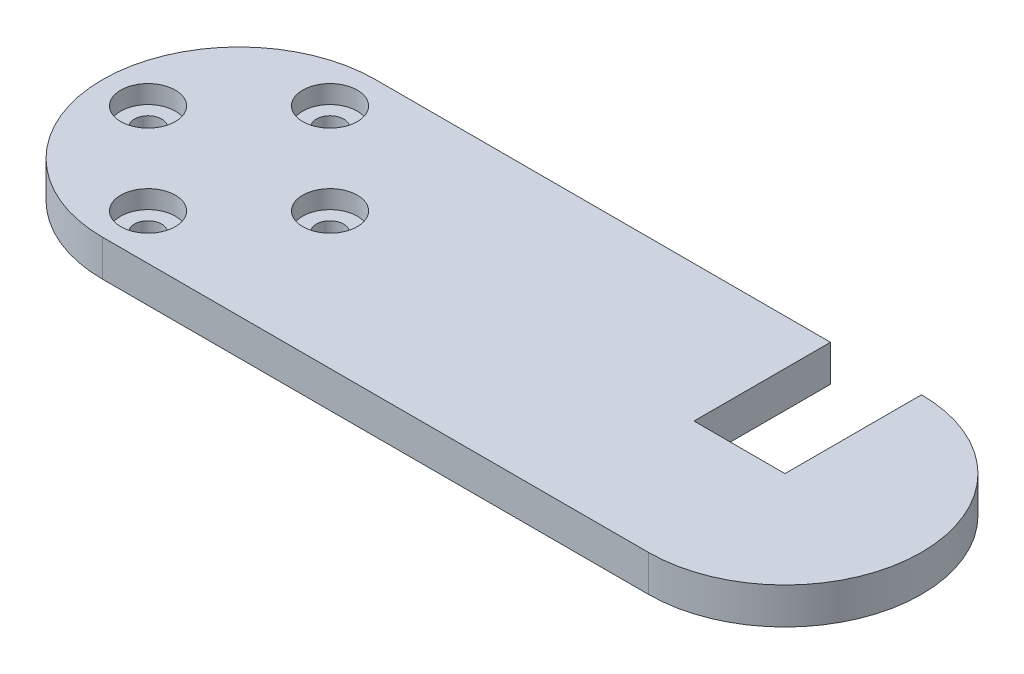
ISO-10303-21;
HEADER;
FILE_DESCRIPTION(('STEP AP214'),'2;1');
FILE_NAME('part.step','',(''),(''),'','','');
FILE_SCHEMA(('AUTOMOTIVE_DESIGN { 1 0 10303 214 1 1 1 1 }'));
ENDSEC;
DATA;
#1=APPLICATION_CONTEXT('core data for automotive mechanical design processes');
#2=APPLICATION_PROTOCOL_DEFINITION('international standard','automotive_design',2000,#1);
#3=PRODUCT_CONTEXT('',#1,'mechanical');
#4=PRODUCT('Part','Part','',(#3));
#5=PRODUCT_RELATED_PRODUCT_CATEGORY('part','',(#4));
#6=PRODUCT_DEFINITION_FORMATION('','',#4);
#7=PRODUCT_DEFINITION_CONTEXT('part definition',#1,'design');
#8=PRODUCT_DEFINITION('design','',#6,#7);
#9=PRODUCT_DEFINITION_SHAPE('','',#8);
#10=(LENGTH_UNIT() NAMED_UNIT(*) SI_UNIT(.MILLI.,.METRE.));
#11=(NAMED_UNIT(*) PLANE_ANGLE_UNIT() SI_UNIT($,.RADIAN.));
#12=(NAMED_UNIT(*) SI_UNIT($,.STERADIAN.) SOLID_ANGLE_UNIT());
#13=UNCERTAINTY_MEASURE_WITH_UNIT(LENGTH_MEASURE(1.E-05),#10,'distance_accuracy_value','');
#14=(GEOMETRIC_REPRESENTATION_CONTEXT(3) GLOBAL_UNCERTAINTY_ASSIGNED_CONTEXT((#13)) GLOBAL_UNIT_ASSIGNED_CONTEXT((#10,
#11,#12)) REPRESENTATION_CONTEXT('',''));
#15=CARTESIAN_POINT('',(0.,0.,0.));
#16=DIRECTION('',(0.,0.,1.));
#17=DIRECTION('',(1.,0.,0.));
#18=AXIS2_PLACEMENT_3D('',#15,#16,#17);
#19=CARTESIAN_POINT('',(0.,4.,-15.));
#20=DIRECTION('',(0.,0.,1.));
#21=DIRECTION('',(1.,0.,0.));
#22=AXIS2_PLACEMENT_3D('',#19,#20,#21);
#23=PLANE('',#22);
#24=DIRECTION('',(0.,1.,0.));
#25=VECTOR('',#24,1.);
#26=CARTESIAN_POINT('',(50.,0.,-15.));
#27=LINE('',#26,#25);
#28=CARTESIAN_POINT('',(50.,0.,-15.));
#29=VERTEX_POINT('',#28);
#30=CARTESIAN_POINT('',(50.,4.,-15.));
#31=VERTEX_POINT('',#30);
#32=EDGE_CURVE('E134',#29,#31,#27,.T.);
#33=ORIENTED_EDGE('',*,*,#32,.F.);
#34=DIRECTION('',(-1.,0.,0.));
#35=VECTOR('',#34,1.);
#36=CARTESIAN_POINT('',(0.,0.,-15.));
#37=LINE('',#36,#35);
#38=CARTESIAN_POINT('',(0.,0.,-15.));
#39=VERTEX_POINT('',#38);
#40=EDGE_CURVE('E78',#29,#39,#37,.T.);
#41=ORIENTED_EDGE('',*,*,#40,.T.);
#42=DIRECTION('',(0.,-1.,0.));
#43=VECTOR('',#42,1.);
#44=CARTESIAN_POINT('',(0.,4.,-15.));
#45=LINE('',#44,#43);
#46=CARTESIAN_POINT('',(0.,4.,-15.));
#47=VERTEX_POINT('',#46);
#48=EDGE_CURVE('E145',#47,#39,#45,.T.);
#49=ORIENTED_EDGE('',*,*,#48,.F.);
#50=DIRECTION('',(-1.,0.,0.));
#51=VECTOR('',#50,1.);
#52=CARTESIAN_POINT('',(0.,4.,-15.));
#53=LINE('',#52,#51);
#54=EDGE_CURVE('E60',#31,#47,#53,.T.);
#55=ORIENTED_EDGE('',*,*,#54,.F.);
#56=EDGE_LOOP('',(#33,#41,#49,#55));
#57=FACE_BOUND('',#56,.T.);
#58=ADVANCED_FACE('F36',(#57),#23,.F.);
#59=CARTESIAN_POINT('',(0.,4.,0.));
#60=DIRECTION('',(0.,1.,0.));
#61=DIRECTION('',(0.,0.,1.));
#62=AXIS2_PLACEMENT_3D('',#59,#60,#61);
#63=PLANE('',#62);
#64=CARTESIAN_POINT('',(-10.,4.,0.));
#65=DIRECTION('',(0.,1.,0.));
#66=DIRECTION('',(0.,0.,1.));
#67=AXIS2_PLACEMENT_3D('',#64,#65,#66);
#68=CIRCLE('',#67,3.);
#69=CARTESIAN_POINT('',(-10.,4.,3.));
#70=VERTEX_POINT('',#69);
#71=EDGE_CURVE('E272',#70,#70,#68,.T.);
#72=ORIENTED_EDGE('',*,*,#71,.F.);
#73=EDGE_LOOP('',(#72));
#74=FACE_BOUND('',#73,.T.);
#75=CARTESIAN_POINT('',(0.,4.,-10.));
#76=DIRECTION('',(0.,1.,0.));
#77=DIRECTION('',(0.,0.,1.));
#78=AXIS2_PLACEMENT_3D('',#75,#76,#77);
#79=CIRCLE('',#78,3.);
#80=CARTESIAN_POINT('',(0.,4.,-7.));
#81=VERTEX_POINT('',#80);
#82=EDGE_CURVE('E275',#81,#81,#79,.T.);
#83=ORIENTED_EDGE('',*,*,#82,.F.);
#84=EDGE_LOOP('',(#83));
#85=FACE_BOUND('',#84,.T.);
#86=CARTESIAN_POINT('',(10.,4.,0.));
#87=DIRECTION('',(0.,1.,0.));
#88=DIRECTION('',(0.,0.,1.));
#89=AXIS2_PLACEMENT_3D('',#86,#87,#88);
#90=CIRCLE('',#89,3.);
#91=CARTESIAN_POINT('',(10.,4.,3.00000000000007));
#92=VERTEX_POINT('',#91);
#93=EDGE_CURVE('E281',#92,#92,#90,.T.);
#94=ORIENTED_EDGE('',*,*,#93,.F.);
#95=EDGE_LOOP('',(#94));
#96=FACE_BOUND('',#95,.T.);
#97=CARTESIAN_POINT('',(-1.04744440165294E-13,4.,9.99999999999999));
#98=DIRECTION('',(0.,1.,0.));
#99=DIRECTION('',(0.,0.,1.));
#100=AXIS2_PLACEMENT_3D('',#97,#98,#99);
#101=CIRCLE('',#100,3.);
#102=CARTESIAN_POINT('',(-1.04744440165294E-13,4.,13.));
#103=VERTEX_POINT('',#102);
#104=EDGE_CURVE('E286',#103,#103,#101,.T.);
#105=ORIENTED_EDGE('',*,*,#104,.F.);
#106=EDGE_LOOP('',(#105));
#107=FACE_BOUND('',#106,.T.);
#108=DIRECTION('',(1.,0.,0.));
#109=VECTOR('',#108,1.);
#110=CARTESIAN_POINT('',(0.,4.,0.));
#111=LINE('',#110,#109);
#112=CARTESIAN_POINT('',(50.,4.,0.));
#113=VERTEX_POINT('',#112);
#114=CARTESIAN_POINT('',(60.,4.,0.));
#115=VERTEX_POINT('',#114);
#116=EDGE_CURVE('E124',#113,#115,#111,.T.);
#117=ORIENTED_EDGE('',*,*,#116,.F.);
#118=DIRECTION('',(0.,0.,-1.));
#119=VECTOR('',#118,1.);
#120=CARTESIAN_POINT('',(50.,4.,0.));
#121=LINE('',#120,#119);
#122=EDGE_CURVE('E109',#113,#31,#121,.T.);
#123=ORIENTED_EDGE('',*,*,#122,.T.);
#124=ORIENTED_EDGE('',*,*,#54,.T.);
#125=CARTESIAN_POINT('',(0.,4.,0.));
#126=DIRECTION('',(0.,1.,0.));
#127=DIRECTION('',(0.,0.,1.));
#128=AXIS2_PLACEMENT_3D('',#125,#126,#127);
#129=CIRCLE('',#128,15.);
#130=CARTESIAN_POINT('',(0.,4.,15.));
#131=VERTEX_POINT('',#130);
#132=EDGE_CURVE('E138',#47,#131,#129,.T.);
#133=ORIENTED_EDGE('',*,*,#132,.T.);
#134=DIRECTION('',(1.,0.,0.));
#135=VECTOR('',#134,1.);
#136=CARTESIAN_POINT('',(0.,4.,15.));
#137=LINE('',#136,#135);
#138=CARTESIAN_POINT('',(60.,4.,15.));
#139=VERTEX_POINT('',#138);
#140=EDGE_CURVE('E83',#131,#139,#137,.T.);
#141=ORIENTED_EDGE('',*,*,#140,.T.);
#142=CARTESIAN_POINT('',(60.,4.,0.));
#143=DIRECTION('',(0.,1.,0.));
#144=DIRECTION('',(0.,0.,1.));
#145=AXIS2_PLACEMENT_3D('',#142,#143,#144);
#146=CIRCLE('',#145,15.);
#147=CARTESIAN_POINT('',(60.,4.,-15.));
#148=VERTEX_POINT('',#147);
#149=EDGE_CURVE('E141',#139,#148,#146,.T.);
#150=ORIENTED_EDGE('',*,*,#149,.T.);
#151=DIRECTION('',(0.,0.,1.));
#152=VECTOR('',#151,1.);
#153=CARTESIAN_POINT('',(60.,4.,0.));
#154=LINE('',#153,#152);
#155=EDGE_CURVE('E121',#148,#115,#154,.T.);
#156=ORIENTED_EDGE('',*,*,#155,.T.);
#157=EDGE_LOOP('',(#117,#123,#124,#133,#141,#150,#156));
#158=FACE_BOUND('',#157,.T.);
#159=ADVANCED_FACE('F164',(#74,#85,#96,#107,#158),#63,.T.);
#160=CARTESIAN_POINT('',(0.,0.,0.));
#161=DIRECTION('',(0.,1.,0.));
#162=DIRECTION('',(0.,0.,1.));
#163=AXIS2_PLACEMENT_3D('',#160,#161,#162);
#164=PLANE('',#163);
#165=CARTESIAN_POINT('',(-10.,0.,0.));
#166=DIRECTION('',(0.,1.,0.));
#167=DIRECTION('',(0.,0.,1.));
#168=AXIS2_PLACEMENT_3D('',#165,#166,#167);
#169=CIRCLE('',#168,1.5);
#170=CARTESIAN_POINT('',(-10.,0.,1.5));
#171=VERTEX_POINT('',#170);
#172=EDGE_CURVE('E245',#171,#171,#169,.T.);
#173=ORIENTED_EDGE('',*,*,#172,.T.);
#174=EDGE_LOOP('',(#173));
#175=FACE_BOUND('',#174,.T.);
#176=CARTESIAN_POINT('',(0.,0.,-10.));
#177=DIRECTION('',(0.,1.,0.));
#178=DIRECTION('',(0.,0.,1.));
#179=AXIS2_PLACEMENT_3D('',#176,#177,#178);
#180=CIRCLE('',#179,1.5);
#181=CARTESIAN_POINT('',(0.,0.,-8.5));
#182=VERTEX_POINT('',#181);
#183=EDGE_CURVE('E253',#182,#182,#180,.T.);
#184=ORIENTED_EDGE('',*,*,#183,.T.);
#185=EDGE_LOOP('',(#184));
#186=FACE_BOUND('',#185,.T.);
#187=CARTESIAN_POINT('',(10.,0.,0.));
#188=DIRECTION('',(0.,1.,0.));
#189=DIRECTION('',(0.,0.,1.));
#190=AXIS2_PLACEMENT_3D('',#187,#188,#189);
#191=CIRCLE('',#190,1.5);
#192=CARTESIAN_POINT('',(10.,0.,1.50000000000007));
#193=VERTEX_POINT('',#192);
#194=EDGE_CURVE('E261',#193,#193,#191,.T.);
#195=ORIENTED_EDGE('',*,*,#194,.T.);
#196=EDGE_LOOP('',(#195));
#197=FACE_BOUND('',#196,.T.);
#198=CARTESIAN_POINT('',(-1.04744440165294E-13,0.,9.99999999999999));
#199=DIRECTION('',(0.,1.,0.));
#200=DIRECTION('',(0.,0.,1.));
#201=AXIS2_PLACEMENT_3D('',#198,#199,#200);
#202=CIRCLE('',#201,1.5);
#203=CARTESIAN_POINT('',(-1.04744440165294E-13,0.,11.5));
#204=VERTEX_POINT('',#203);
#205=EDGE_CURVE('E267',#204,#204,#202,.T.);
#206=ORIENTED_EDGE('',*,*,#205,.T.);
#207=EDGE_LOOP('',(#206));
#208=FACE_BOUND('',#207,.T.);
#209=DIRECTION('',(0.,0.,-1.));
#210=VECTOR('',#209,1.);
#211=CARTESIAN_POINT('',(50.,0.,0.));
#212=LINE('',#211,#210);
#213=CARTESIAN_POINT('',(50.,0.,0.));
#214=VERTEX_POINT('',#213);
#215=EDGE_CURVE('E108',#214,#29,#212,.T.);
#216=ORIENTED_EDGE('',*,*,#215,.F.);
#217=DIRECTION('',(1.,0.,0.));
#218=VECTOR('',#217,1.);
#219=CARTESIAN_POINT('',(0.,0.,0.));
#220=LINE('',#219,#218);
#221=CARTESIAN_POINT('',(60.,0.,0.));
#222=VERTEX_POINT('',#221);
#223=EDGE_CURVE('E114',#214,#222,#220,.T.);
#224=ORIENTED_EDGE('',*,*,#223,.T.);
#225=DIRECTION('',(0.,0.,1.));
#226=VECTOR('',#225,1.);
#227=CARTESIAN_POINT('',(60.,0.,0.));
#228=LINE('',#227,#226);
#229=CARTESIAN_POINT('',(60.,0.,-15.));
#230=VERTEX_POINT('',#229);
#231=EDGE_CURVE('E111',#230,#222,#228,.T.);
#232=ORIENTED_EDGE('',*,*,#231,.F.);
#233=CARTESIAN_POINT('',(60.,0.,0.));
#234=DIRECTION('',(0.,1.,0.));
#235=DIRECTION('',(0.,0.,1.));
#236=AXIS2_PLACEMENT_3D('',#233,#234,#235);
#237=CIRCLE('',#236,15.);
#238=CARTESIAN_POINT('',(60.,0.,15.));
#239=VERTEX_POINT('',#238);
#240=EDGE_CURVE('E150',#239,#230,#237,.T.);
#241=ORIENTED_EDGE('',*,*,#240,.F.);
#242=DIRECTION('',(1.,0.,0.));
#243=VECTOR('',#242,1.);
#244=CARTESIAN_POINT('',(0.,0.,15.));
#245=LINE('',#244,#243);
#246=CARTESIAN_POINT('',(0.,0.,15.));
#247=VERTEX_POINT('',#246);
#248=EDGE_CURVE('E148',#247,#239,#245,.T.);
#249=ORIENTED_EDGE('',*,*,#248,.F.);
#250=CARTESIAN_POINT('',(0.,0.,0.));
#251=DIRECTION('',(0.,1.,0.));
#252=DIRECTION('',(0.,0.,1.));
#253=AXIS2_PLACEMENT_3D('',#250,#251,#252);
#254=CIRCLE('',#253,15.);
#255=EDGE_CURVE('E136',#39,#247,#254,.T.);
#256=ORIENTED_EDGE('',*,*,#255,.F.);
#257=ORIENTED_EDGE('',*,*,#40,.F.);
#258=EDGE_LOOP('',(#216,#224,#232,#241,#249,#256,#257));
#259=FACE_BOUND('',#258,.T.);
#260=ADVANCED_FACE('F119',(#175,#186,#197,#208,#259),#164,.F.);
#261=CARTESIAN_POINT('',(0.,4.,0.));
#262=DIRECTION('',(0.,-1.,0.));
#263=DIRECTION('',(0.,0.,-1.));
#264=AXIS2_PLACEMENT_3D('',#261,#262,#263);
#265=CYLINDRICAL_SURFACE('',#264,15.);
#266=ORIENTED_EDGE('',*,*,#255,.T.);
#267=DIRECTION('',(0.,-1.,0.));
#268=VECTOR('',#267,1.);
#269=CARTESIAN_POINT('',(0.,4.,15.));
#270=LINE('',#269,#268);
#271=EDGE_CURVE('E11',#131,#247,#270,.T.);
#272=ORIENTED_EDGE('',*,*,#271,.F.);
#273=ORIENTED_EDGE('',*,*,#132,.F.);
#274=ORIENTED_EDGE('',*,*,#48,.T.);
#275=EDGE_LOOP('',(#266,#272,#273,#274));
#276=FACE_BOUND('',#275,.T.);
#277=ADVANCED_FACE('F38',(#276),#265,.T.);
#278=CARTESIAN_POINT('',(0.,4.,15.));
#279=DIRECTION('',(0.,0.,-1.));
#280=DIRECTION('',(-1.,0.,0.));
#281=AXIS2_PLACEMENT_3D('',#278,#279,#280);
#282=PLANE('',#281);
#283=ORIENTED_EDGE('',*,*,#248,.T.);
#284=DIRECTION('',(0.,-1.,0.));
#285=VECTOR('',#284,1.);
#286=CARTESIAN_POINT('',(60.,4.,15.));
#287=LINE('',#286,#285);
#288=EDGE_CURVE('E44',#139,#239,#287,.T.);
#289=ORIENTED_EDGE('',*,*,#288,.F.);
#290=ORIENTED_EDGE('',*,*,#140,.F.);
#291=ORIENTED_EDGE('',*,*,#271,.T.);
#292=EDGE_LOOP('',(#283,#289,#290,#291));
#293=FACE_BOUND('',#292,.T.);
#294=ADVANCED_FACE('F168',(#293),#282,.F.);
#295=CARTESIAN_POINT('',(60.,4.,0.));
#296=DIRECTION('',(0.,-1.,0.));
#297=DIRECTION('',(0.,0.,-1.));
#298=AXIS2_PLACEMENT_3D('',#295,#296,#297);
#299=CYLINDRICAL_SURFACE('',#298,15.);
#300=ORIENTED_EDGE('',*,*,#240,.T.);
#301=DIRECTION('',(0.,-1.,0.));
#302=VECTOR('',#301,1.);
#303=CARTESIAN_POINT('',(60.,4.,-15.));
#304=LINE('',#303,#302);
#305=EDGE_CURVE('E155',#148,#230,#304,.T.);
#306=ORIENTED_EDGE('',*,*,#305,.F.);
#307=ORIENTED_EDGE('',*,*,#149,.F.);
#308=ORIENTED_EDGE('',*,*,#288,.T.);
#309=EDGE_LOOP('',(#300,#306,#307,#308));
#310=FACE_BOUND('',#309,.T.);
#311=ADVANCED_FACE('F160',(#310),#299,.T.);
#312=CARTESIAN_POINT('',(50.,0.,0.));
#313=DIRECTION('',(1.,0.,0.));
#314=DIRECTION('',(0.,0.,-1.));
#315=AXIS2_PLACEMENT_3D('',#312,#313,#314);
#316=PLANE('',#315);
#317=ORIENTED_EDGE('',*,*,#122,.F.);
#318=DIRECTION('',(0.,1.,0.));
#319=VECTOR('',#318,1.);
#320=CARTESIAN_POINT('',(50.,0.,0.));
#321=LINE('',#320,#319);
#322=EDGE_CURVE('E105',#214,#113,#321,.T.);
#323=ORIENTED_EDGE('',*,*,#322,.F.);
#324=ORIENTED_EDGE('',*,*,#215,.T.);
#325=ORIENTED_EDGE('',*,*,#32,.T.);
#326=EDGE_LOOP('',(#317,#323,#324,#325));
#327=FACE_BOUND('',#326,.T.);
#328=ADVANCED_FACE('F106',(#327),#316,.T.);
#329=CARTESIAN_POINT('',(60.,0.,0.));
#330=DIRECTION('',(-1.,0.,0.));
#331=DIRECTION('',(0.,0.,1.));
#332=AXIS2_PLACEMENT_3D('',#329,#330,#331);
#333=PLANE('',#332);
#334=ORIENTED_EDGE('',*,*,#155,.F.);
#335=ORIENTED_EDGE('',*,*,#305,.T.);
#336=ORIENTED_EDGE('',*,*,#231,.T.);
#337=DIRECTION('',(0.,1.,0.));
#338=VECTOR('',#337,1.);
#339=CARTESIAN_POINT('',(60.,0.,0.));
#340=LINE('',#339,#338);
#341=EDGE_CURVE('E51',#222,#115,#340,.T.);
#342=ORIENTED_EDGE('',*,*,#341,.T.);
#343=EDGE_LOOP('',(#334,#335,#336,#342));
#344=FACE_BOUND('',#343,.T.);
#345=ADVANCED_FACE('F163',(#344),#333,.T.);
#346=CARTESIAN_POINT('',(0.,0.,0.));
#347=DIRECTION('',(0.,0.,1.));
#348=DIRECTION('',(1.,0.,0.));
#349=AXIS2_PLACEMENT_3D('',#346,#347,#348);
#350=PLANE('',#349);
#351=ORIENTED_EDGE('',*,*,#116,.T.);
#352=ORIENTED_EDGE('',*,*,#341,.F.);
#353=ORIENTED_EDGE('',*,*,#223,.F.);
#354=ORIENTED_EDGE('',*,*,#322,.T.);
#355=EDGE_LOOP('',(#351,#352,#353,#354));
#356=FACE_BOUND('',#355,.T.);
#357=ADVANCED_FACE('F115',(#356),#350,.F.);
#358=CARTESIAN_POINT('',(-1.04744440165294E-13,2.,9.99999999999999));
#359=DIRECTION('',(0.,1.,0.));
#360=DIRECTION('',(0.,0.,1.));
#361=AXIS2_PLACEMENT_3D('',#358,#359,#360);
#362=CYLINDRICAL_SURFACE('',#361,3.);
#363=CARTESIAN_POINT('',(-1.04744440165294E-13,2.,9.99999999999999));
#364=DIRECTION('',(0.,1.,0.));
#365=DIRECTION('',(0.,0.,1.));
#366=AXIS2_PLACEMENT_3D('',#363,#364,#365);
#367=CIRCLE('',#366,3.);
#368=CARTESIAN_POINT('',(-1.04744440165294E-13,2.,13.));
#369=VERTEX_POINT('',#368);
#370=EDGE_CURVE('E127',#369,#369,#367,.T.);
#371=ORIENTED_EDGE('',*,*,#370,.F.);
#372=EDGE_LOOP('',(#371));
#373=FACE_BOUND('',#372,.T.);
#374=ORIENTED_EDGE('',*,*,#104,.T.);
#375=EDGE_LOOP('',(#374));
#376=FACE_BOUND('',#375,.T.);
#377=ADVANCED_FACE('F191',(#373,#376),#362,.F.);
#378=CARTESIAN_POINT('',(-1.04744440165294E-13,2.,9.99999999999999));
#379=DIRECTION('',(0.,1.,0.));
#380=DIRECTION('',(0.,0.,1.));
#381=AXIS2_PLACEMENT_3D('',#378,#379,#380);
#382=PLANE('',#381);
#383=CARTESIAN_POINT('',(-1.04744440165294E-13,2.,9.99999999999999));
#384=DIRECTION('',(0.,1.,0.));
#385=DIRECTION('',(0.,0.,1.));
#386=AXIS2_PLACEMENT_3D('',#383,#384,#385);
#387=CIRCLE('',#386,1.5);
#388=CARTESIAN_POINT('',(-1.04744440165294E-13,2.,11.5));
#389=VERTEX_POINT('',#388);
#390=EDGE_CURVE('E264',#389,#389,#387,.T.);
#391=ORIENTED_EDGE('',*,*,#390,.F.);
#392=EDGE_LOOP('',(#391));
#393=FACE_BOUND('',#392,.T.);
#394=ORIENTED_EDGE('',*,*,#370,.T.);
#395=EDGE_LOOP('',(#394));
#396=FACE_BOUND('',#395,.T.);
#397=ADVANCED_FACE('F194',(#393,#396),#382,.T.);
#398=CARTESIAN_POINT('',(10.,2.,0.));
#399=DIRECTION('',(0.,1.,0.));
#400=DIRECTION('',(0.,0.,1.));
#401=AXIS2_PLACEMENT_3D('',#398,#399,#400);
#402=CYLINDRICAL_SURFACE('',#401,3.);
#403=CARTESIAN_POINT('',(10.,2.,0.));
#404=DIRECTION('',(0.,1.,0.));
#405=DIRECTION('',(0.,0.,1.));
#406=AXIS2_PLACEMENT_3D('',#403,#404,#405);
#407=CIRCLE('',#406,3.);
#408=CARTESIAN_POINT('',(10.,2.,3.00000000000007));
#409=VERTEX_POINT('',#408);
#410=EDGE_CURVE('E284',#409,#409,#407,.T.);
#411=ORIENTED_EDGE('',*,*,#410,.F.);
#412=EDGE_LOOP('',(#411));
#413=FACE_BOUND('',#412,.T.);
#414=ORIENTED_EDGE('',*,*,#93,.T.);
#415=EDGE_LOOP('',(#414));
#416=FACE_BOUND('',#415,.T.);
#417=ADVANCED_FACE('F197',(#413,#416),#402,.F.);
#418=CARTESIAN_POINT('',(10.,2.,0.));
#419=DIRECTION('',(0.,1.,0.));
#420=DIRECTION('',(0.,0.,1.));
#421=AXIS2_PLACEMENT_3D('',#418,#419,#420);
#422=PLANE('',#421);
#423=CARTESIAN_POINT('',(10.,2.,0.));
#424=DIRECTION('',(0.,1.,0.));
#425=DIRECTION('',(0.,0.,1.));
#426=AXIS2_PLACEMENT_3D('',#423,#424,#425);
#427=CIRCLE('',#426,1.5);
#428=CARTESIAN_POINT('',(10.,2.,1.50000000000007));
#429=VERTEX_POINT('',#428);
#430=EDGE_CURVE('E258',#429,#429,#427,.T.);
#431=ORIENTED_EDGE('',*,*,#430,.F.);
#432=EDGE_LOOP('',(#431));
#433=FACE_BOUND('',#432,.T.);
#434=ORIENTED_EDGE('',*,*,#410,.T.);
#435=EDGE_LOOP('',(#434));
#436=FACE_BOUND('',#435,.T.);
#437=ADVANCED_FACE('F202',(#433,#436),#422,.T.);
#438=CARTESIAN_POINT('',(0.,2.,-10.));
#439=DIRECTION('',(0.,1.,0.));
#440=DIRECTION('',(0.,0.,1.));
#441=AXIS2_PLACEMENT_3D('',#438,#439,#440);
#442=CYLINDRICAL_SURFACE('',#441,3.);
#443=CARTESIAN_POINT('',(0.,2.,-10.));
#444=DIRECTION('',(0.,1.,0.));
#445=DIRECTION('',(0.,0.,1.));
#446=AXIS2_PLACEMENT_3D('',#443,#444,#445);
#447=CIRCLE('',#446,3.);
#448=CARTESIAN_POINT('',(0.,2.,-7.));
#449=VERTEX_POINT('',#448);
#450=EDGE_CURVE('E278',#449,#449,#447,.T.);
#451=ORIENTED_EDGE('',*,*,#450,.F.);
#452=EDGE_LOOP('',(#451));
#453=FACE_BOUND('',#452,.T.);
#454=ORIENTED_EDGE('',*,*,#82,.T.);
#455=EDGE_LOOP('',(#454));
#456=FACE_BOUND('',#455,.T.);
#457=ADVANCED_FACE('F205',(#453,#456),#442,.F.);
#458=CARTESIAN_POINT('',(0.,2.,-10.));
#459=DIRECTION('',(0.,1.,0.));
#460=DIRECTION('',(0.,0.,1.));
#461=AXIS2_PLACEMENT_3D('',#458,#459,#460);
#462=PLANE('',#461);
#463=CARTESIAN_POINT('',(0.,2.,-10.));
#464=DIRECTION('',(0.,1.,0.));
#465=DIRECTION('',(0.,0.,1.));
#466=AXIS2_PLACEMENT_3D('',#463,#464,#465);
#467=CIRCLE('',#466,1.5);
#468=CARTESIAN_POINT('',(0.,2.,-8.5));
#469=VERTEX_POINT('',#468);
#470=EDGE_CURVE('E249',#469,#469,#467,.T.);
#471=ORIENTED_EDGE('',*,*,#470,.F.);
#472=EDGE_LOOP('',(#471));
#473=FACE_BOUND('',#472,.T.);
#474=ORIENTED_EDGE('',*,*,#450,.T.);
#475=EDGE_LOOP('',(#474));
#476=FACE_BOUND('',#475,.T.);
#477=ADVANCED_FACE('F210',(#473,#476),#462,.T.);
#478=CARTESIAN_POINT('',(-10.,2.,0.));
#479=DIRECTION('',(0.,1.,0.));
#480=DIRECTION('',(0.,0.,1.));
#481=AXIS2_PLACEMENT_3D('',#478,#479,#480);
#482=CYLINDRICAL_SURFACE('',#481,3.);
#483=CARTESIAN_POINT('',(-10.,2.,0.));
#484=DIRECTION('',(0.,1.,0.));
#485=DIRECTION('',(0.,0.,1.));
#486=AXIS2_PLACEMENT_3D('',#483,#484,#485);
#487=CIRCLE('',#486,3.);
#488=CARTESIAN_POINT('',(-10.,2.,3.));
#489=VERTEX_POINT('',#488);
#490=EDGE_CURVE('E132',#489,#489,#487,.T.);
#491=ORIENTED_EDGE('',*,*,#490,.F.);
#492=EDGE_LOOP('',(#491));
#493=FACE_BOUND('',#492,.T.);
#494=ORIENTED_EDGE('',*,*,#71,.T.);
#495=EDGE_LOOP('',(#494));
#496=FACE_BOUND('',#495,.T.);
#497=ADVANCED_FACE('F213',(#493,#496),#482,.F.);
#498=CARTESIAN_POINT('',(-10.,2.,0.));
#499=DIRECTION('',(0.,1.,0.));
#500=DIRECTION('',(0.,0.,1.));
#501=AXIS2_PLACEMENT_3D('',#498,#499,#500);
#502=PLANE('',#501);
#503=CARTESIAN_POINT('',(-10.,2.,0.));
#504=DIRECTION('',(0.,1.,0.));
#505=DIRECTION('',(0.,0.,1.));
#506=AXIS2_PLACEMENT_3D('',#503,#504,#505);
#507=CIRCLE('',#506,1.5);
#508=CARTESIAN_POINT('',(-10.,2.,1.5));
#509=VERTEX_POINT('',#508);
#510=EDGE_CURVE('E248',#509,#509,#507,.T.);
#511=ORIENTED_EDGE('',*,*,#510,.F.);
#512=EDGE_LOOP('',(#511));
#513=FACE_BOUND('',#512,.T.);
#514=ORIENTED_EDGE('',*,*,#490,.T.);
#515=EDGE_LOOP('',(#514));
#516=FACE_BOUND('',#515,.T.);
#517=ADVANCED_FACE('F220',(#513,#516),#502,.T.);
#518=CARTESIAN_POINT('',(-1.04744440165294E-13,0.,9.99999999999999));
#519=DIRECTION('',(0.,1.,0.));
#520=DIRECTION('',(0.,0.,1.));
#521=AXIS2_PLACEMENT_3D('',#518,#519,#520);
#522=CYLINDRICAL_SURFACE('',#521,1.5);
#523=ORIENTED_EDGE('',*,*,#205,.F.);
#524=EDGE_LOOP('',(#523));
#525=FACE_BOUND('',#524,.T.);
#526=ORIENTED_EDGE('',*,*,#390,.T.);
#527=EDGE_LOOP('',(#526));
#528=FACE_BOUND('',#527,.T.);
#529=ADVANCED_FACE('F224',(#525,#528),#522,.F.);
#530=CARTESIAN_POINT('',(10.,0.,0.));
#531=DIRECTION('',(0.,1.,0.));
#532=DIRECTION('',(0.,0.,1.));
#533=AXIS2_PLACEMENT_3D('',#530,#531,#532);
#534=CYLINDRICAL_SURFACE('',#533,1.5);
#535=ORIENTED_EDGE('',*,*,#194,.F.);
#536=EDGE_LOOP('',(#535));
#537=FACE_BOUND('',#536,.T.);
#538=ORIENTED_EDGE('',*,*,#430,.T.);
#539=EDGE_LOOP('',(#538));
#540=FACE_BOUND('',#539,.T.);
#541=ADVANCED_FACE('F228',(#537,#540),#534,.F.);
#542=CARTESIAN_POINT('',(0.,0.,-10.));
#543=DIRECTION('',(0.,1.,0.));
#544=DIRECTION('',(0.,0.,1.));
#545=AXIS2_PLACEMENT_3D('',#542,#543,#544);
#546=CYLINDRICAL_SURFACE('',#545,1.5);
#547=ORIENTED_EDGE('',*,*,#183,.F.);
#548=EDGE_LOOP('',(#547));
#549=FACE_BOUND('',#548,.T.);
#550=ORIENTED_EDGE('',*,*,#470,.T.);
#551=EDGE_LOOP('',(#550));
#552=FACE_BOUND('',#551,.T.);
#553=ADVANCED_FACE('F232',(#549,#552),#546,.F.);
#554=CARTESIAN_POINT('',(-10.,0.,0.));
#555=DIRECTION('',(0.,1.,0.));
#556=DIRECTION('',(0.,0.,1.));
#557=AXIS2_PLACEMENT_3D('',#554,#555,#556);
#558=CYLINDRICAL_SURFACE('',#557,1.5);
#559=ORIENTED_EDGE('',*,*,#172,.F.);
#560=EDGE_LOOP('',(#559));
#561=FACE_BOUND('',#560,.T.);
#562=ORIENTED_EDGE('',*,*,#510,.T.);
#563=EDGE_LOOP('',(#562));
#564=FACE_BOUND('',#563,.T.);
#565=ADVANCED_FACE('F236',(#561,#564),#558,.F.);
#566=CLOSED_SHELL('',(#58,#159,#260,#277,#294,#311,#328,#345,#357,#377,#397,#417,#437,#457,#477,
#497,#517,#529,#541,#553,#565));
#567=MANIFOLD_SOLID_BREP('B2',#566);
#568=ADVANCED_BREP_SHAPE_REPRESENTATION('',(#18,#567),#14);
#569=SHAPE_DEFINITION_REPRESENTATION(#9,#568);
ENDSEC;
END-ISO-10303-21;
